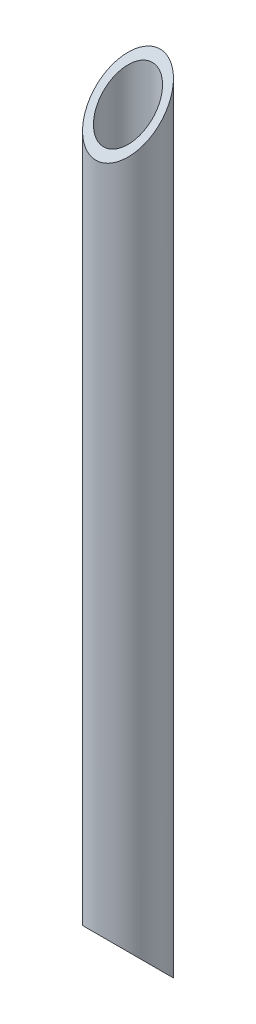
ISO-10303-21;
HEADER;
FILE_DESCRIPTION(('STEP AP214'),'2;1');
FILE_NAME('part.step','',(''),(''),'','','');
FILE_SCHEMA(('AUTOMOTIVE_DESIGN { 1 0 10303 214 1 1 1 1 }'));
ENDSEC;
DATA;
#1=APPLICATION_CONTEXT('core data for automotive mechanical design processes');
#2=APPLICATION_PROTOCOL_DEFINITION('international standard','automotive_design',2000,#1);
#3=PRODUCT_CONTEXT('',#1,'mechanical');
#4=PRODUCT('Part','Part','',(#3));
#5=PRODUCT_RELATED_PRODUCT_CATEGORY('part','',(#4));
#6=PRODUCT_DEFINITION_FORMATION('','',#4);
#7=PRODUCT_DEFINITION_CONTEXT('part definition',#1,'design');
#8=PRODUCT_DEFINITION('design','',#6,#7);
#9=PRODUCT_DEFINITION_SHAPE('','',#8);
#10=(LENGTH_UNIT() NAMED_UNIT(*) SI_UNIT(.MILLI.,.METRE.));
#11=(NAMED_UNIT(*) PLANE_ANGLE_UNIT() SI_UNIT($,.RADIAN.));
#12=(NAMED_UNIT(*) SI_UNIT($,.STERADIAN.) SOLID_ANGLE_UNIT());
#13=UNCERTAINTY_MEASURE_WITH_UNIT(LENGTH_MEASURE(1.E-05),#10,'distance_accuracy_value','');
#14=(GEOMETRIC_REPRESENTATION_CONTEXT(3) GLOBAL_UNCERTAINTY_ASSIGNED_CONTEXT((#13)) GLOBAL_UNIT_ASSIGNED_CONTEXT((#10,
#11,#12)) REPRESENTATION_CONTEXT('',''));
#15=CARTESIAN_POINT('',(0.,0.,0.));
#16=DIRECTION('',(0.,0.,1.));
#17=DIRECTION('',(1.,0.,0.));
#18=AXIS2_PLACEMENT_3D('',#15,#16,#17);
#19=CARTESIAN_POINT('',(2599.99999999996,289.999999999996,-275.000000000001));
#20=DIRECTION('',(0.,-0.999999999999999,0.));
#21=DIRECTION('',(0.,0.,-1.));
#22=AXIS2_PLACEMENT_3D('',#19,#20,#21);
#23=CYLINDRICAL_SURFACE('',#22,9.64999999999982);
#24=CARTESIAN_POINT('',(2599.99999999996,1.94289029309402E-13,-275.000000000001));
#25=DIRECTION('',(0.,0.707106781186547,-0.707106781186548));
#26=DIRECTION('',(0.,-0.707106781186548,-0.707106781186547));
#27=AXIS2_PLACEMENT_3D('',#24,#25,#26);
#28=ELLIPSE('',#27,13.6471608769001,9.64999999999982);
#29=CARTESIAN_POINT('',(2599.99999999996,-9.64999999999963,-284.650000000001));
#30=VERTEX_POINT('',#29);
#31=EDGE_CURVE('E45',#30,#30,#28,.T.);
#32=ORIENTED_EDGE('',*,*,#31,.F.);
#33=EDGE_LOOP('',(#32));
#34=FACE_BOUND('',#33,.T.);
#35=CARTESIAN_POINT('',(2599.99999999996,289.999999999996,-275.000000000001));
#36=DIRECTION('',(0.,-0.707106781186548,-0.707106781186547));
#37=DIRECTION('',(0.,-0.707106781186547,0.707106781186547));
#38=AXIS2_PLACEMENT_3D('',#35,#36,#37);
#39=ELLIPSE('',#38,13.6471608769001,9.64999999999982);
#40=CARTESIAN_POINT('',(2599.99999999996,280.349999999996,-265.350000000001));
#41=VERTEX_POINT('',#40);
#42=EDGE_CURVE('E58',#41,#41,#39,.T.);
#43=ORIENTED_EDGE('',*,*,#42,.F.);
#44=EDGE_LOOP('',(#43));
#45=FACE_BOUND('',#44,.T.);
#46=ADVANCED_FACE('F38',(#34,#45),#23,.F.);
#47=CARTESIAN_POINT('',(2599.99999999996,289.999999999996,-275.000000000001));
#48=DIRECTION('',(0.,-0.707106781186548,-0.707106781186547));
#49=DIRECTION('',(0.,0.707106781186547,-0.707106781186547));
#50=AXIS2_PLACEMENT_3D('',#47,#48,#49);
#51=PLANE('',#50);
#52=ORIENTED_EDGE('',*,*,#42,.T.);
#53=EDGE_LOOP('',(#52));
#54=FACE_BOUND('',#53,.T.);
#55=CARTESIAN_POINT('',(2599.99999999996,289.999999999996,-275.000000000001));
#56=DIRECTION('',(0.,-0.707106781186548,-0.707106781186547));
#57=DIRECTION('',(0.,-0.707106781186547,0.707106781186547));
#58=AXIS2_PLACEMENT_3D('',#55,#56,#57);
#59=ELLIPSE('',#58,17.9605122421381,12.6999999999999);
#60=CARTESIAN_POINT('',(2599.99999999996,277.299999999996,-262.300000000001));
#61=VERTEX_POINT('',#60);
#62=EDGE_CURVE('E51',#61,#61,#59,.T.);
#63=ORIENTED_EDGE('',*,*,#62,.F.);
#64=EDGE_LOOP('',(#63));
#65=FACE_BOUND('',#64,.T.);
#66=ADVANCED_FACE('F65',(#54,#65),#51,.F.);
#67=CARTESIAN_POINT('',(2599.99999999996,289.999999999996,-275.000000000001));
#68=DIRECTION('',(0.,-0.999999999999999,0.));
#69=DIRECTION('',(0.,0.,-1.));
#70=AXIS2_PLACEMENT_3D('',#67,#68,#69);
#71=CYLINDRICAL_SURFACE('',#70,12.6999999999999);
#72=CARTESIAN_POINT('',(2599.99999999996,1.94289029309402E-13,-275.000000000001));
#73=DIRECTION('',(0.,0.707106781186547,-0.707106781186548));
#74=DIRECTION('',(0.,-0.707106781186548,-0.707106781186547));
#75=AXIS2_PLACEMENT_3D('',#72,#73,#74);
#76=ELLIPSE('',#75,17.9605122421381,12.6999999999999);
#77=CARTESIAN_POINT('',(2599.99999999996,-12.6999999999997,-287.700000000001));
#78=VERTEX_POINT('',#77);
#79=EDGE_CURVE('E10',#78,#78,#76,.T.);
#80=ORIENTED_EDGE('',*,*,#79,.T.);
#81=EDGE_LOOP('',(#80));
#82=FACE_BOUND('',#81,.T.);
#83=ORIENTED_EDGE('',*,*,#62,.T.);
#84=EDGE_LOOP('',(#83));
#85=FACE_BOUND('',#84,.T.);
#86=ADVANCED_FACE('F73',(#82,#85),#71,.T.);
#87=CARTESIAN_POINT('',(2599.99999999996,1.38777878078145E-13,-275.000000000001));
#88=DIRECTION('',(0.,0.707106781186547,-0.707106781186548));
#89=DIRECTION('',(0.,0.707106781186548,0.707106781186547));
#90=AXIS2_PLACEMENT_3D('',#87,#88,#89);
#91=PLANE('',#90);
#92=ORIENTED_EDGE('',*,*,#31,.T.);
#93=EDGE_LOOP('',(#92));
#94=FACE_BOUND('',#93,.T.);
#95=ORIENTED_EDGE('',*,*,#79,.F.);
#96=EDGE_LOOP('',(#95));
#97=FACE_BOUND('',#96,.T.);
#98=ADVANCED_FACE('F78',(#94,#97),#91,.F.);
#99=CLOSED_SHELL('',(#46,#66,#86,#98));
#100=MANIFOLD_SOLID_BREP('B2',#99);
#101=ADVANCED_BREP_SHAPE_REPRESENTATION('',(#18,#100),#14);
#102=SHAPE_DEFINITION_REPRESENTATION(#9,#101);
ENDSEC;
END-ISO-10303-21;
